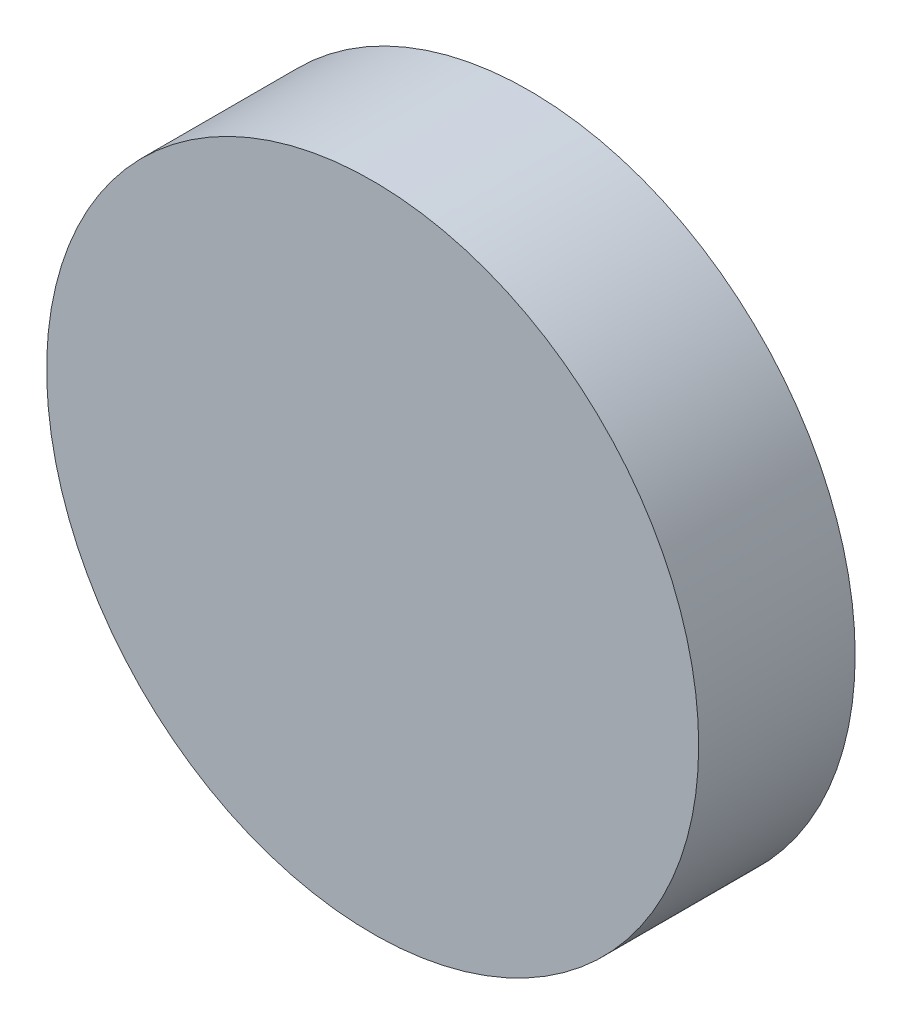
ISO-10303-21;
HEADER;
FILE_DESCRIPTION(('STEP AP214'),'2;1');
FILE_NAME('part.step','',(''),(''),'','','');
FILE_SCHEMA(('AUTOMOTIVE_DESIGN { 1 0 10303 214 1 1 1 1 }'));
ENDSEC;
DATA;
#1=APPLICATION_CONTEXT('core data for automotive mechanical design processes');
#2=APPLICATION_PROTOCOL_DEFINITION('international standard','automotive_design',2000,#1);
#3=PRODUCT_CONTEXT('',#1,'mechanical');
#4=PRODUCT('Part','Part','',(#3));
#5=PRODUCT_RELATED_PRODUCT_CATEGORY('part','',(#4));
#6=PRODUCT_DEFINITION_FORMATION('','',#4);
#7=PRODUCT_DEFINITION_CONTEXT('part definition',#1,'design');
#8=PRODUCT_DEFINITION('design','',#6,#7);
#9=PRODUCT_DEFINITION_SHAPE('','',#8);
#10=(LENGTH_UNIT() NAMED_UNIT(*) SI_UNIT(.MILLI.,.METRE.));
#11=(NAMED_UNIT(*) PLANE_ANGLE_UNIT() SI_UNIT($,.RADIAN.));
#12=(NAMED_UNIT(*) SI_UNIT($,.STERADIAN.) SOLID_ANGLE_UNIT());
#13=UNCERTAINTY_MEASURE_WITH_UNIT(LENGTH_MEASURE(1.E-05),#10,'distance_accuracy_value','');
#14=(GEOMETRIC_REPRESENTATION_CONTEXT(3) GLOBAL_UNCERTAINTY_ASSIGNED_CONTEXT((#13)) GLOBAL_UNIT_ASSIGNED_CONTEXT((#10,
#11,#12)) REPRESENTATION_CONTEXT('',''));
#15=CARTESIAN_POINT('',(0.,0.,0.));
#16=DIRECTION('',(0.,0.,1.));
#17=DIRECTION('',(1.,0.,0.));
#18=AXIS2_PLACEMENT_3D('',#15,#16,#17);
#19=CARTESIAN_POINT('',(0.,0.,3.));
#20=DIRECTION('',(0.,0.,-1.));
#21=DIRECTION('',(-1.,0.,0.));
#22=AXIS2_PLACEMENT_3D('',#19,#20,#21);
#23=CYLINDRICAL_SURFACE('',#22,6.25);
#24=CARTESIAN_POINT('',(0.,0.,3.));
#25=DIRECTION('',(0.,0.,1.));
#26=DIRECTION('',(1.,0.,0.));
#27=AXIS2_PLACEMENT_3D('',#24,#25,#26);
#28=CIRCLE('',#27,6.25);
#29=CARTESIAN_POINT('',(6.25,0.,3.));
#30=VERTEX_POINT('',#29);
#31=EDGE_CURVE('E10',#30,#30,#28,.T.);
#32=ORIENTED_EDGE('',*,*,#31,.F.);
#33=EDGE_LOOP('',(#32));
#34=FACE_BOUND('',#33,.T.);
#35=CARTESIAN_POINT('',(0.,0.,0.));
#36=DIRECTION('',(0.,0.,1.));
#37=DIRECTION('',(1.,0.,0.));
#38=AXIS2_PLACEMENT_3D('',#35,#36,#37);
#39=CIRCLE('',#38,6.25);
#40=CARTESIAN_POINT('',(6.25,0.,0.));
#41=VERTEX_POINT('',#40);
#42=EDGE_CURVE('E38',#41,#41,#39,.T.);
#43=ORIENTED_EDGE('',*,*,#42,.T.);
#44=EDGE_LOOP('',(#43));
#45=FACE_BOUND('',#44,.T.);
#46=ADVANCED_FACE('F35',(#34,#45),#23,.T.);
#47=CARTESIAN_POINT('',(0.,0.,3.));
#48=DIRECTION('',(0.,0.,1.));
#49=DIRECTION('',(1.,0.,0.));
#50=AXIS2_PLACEMENT_3D('',#47,#48,#49);
#51=PLANE('',#50);
#52=ORIENTED_EDGE('',*,*,#31,.T.);
#53=EDGE_LOOP('',(#52));
#54=FACE_BOUND('',#53,.T.);
#55=ADVANCED_FACE('F50',(#54),#51,.T.);
#56=CARTESIAN_POINT('',(0.,0.,0.));
#57=DIRECTION('',(0.,0.,1.));
#58=DIRECTION('',(1.,0.,0.));
#59=AXIS2_PLACEMENT_3D('',#56,#57,#58);
#60=PLANE('',#59);
#61=ORIENTED_EDGE('',*,*,#42,.F.);
#62=EDGE_LOOP('',(#61));
#63=FACE_BOUND('',#62,.T.);
#64=ADVANCED_FACE('F48',(#63),#60,.F.);
#65=CLOSED_SHELL('',(#46,#55,#64));
#66=MANIFOLD_SOLID_BREP('B2',#65);
#67=ADVANCED_BREP_SHAPE_REPRESENTATION('',(#18,#66),#14);
#68=SHAPE_DEFINITION_REPRESENTATION(#9,#67);
ENDSEC;
END-ISO-10303-21;
